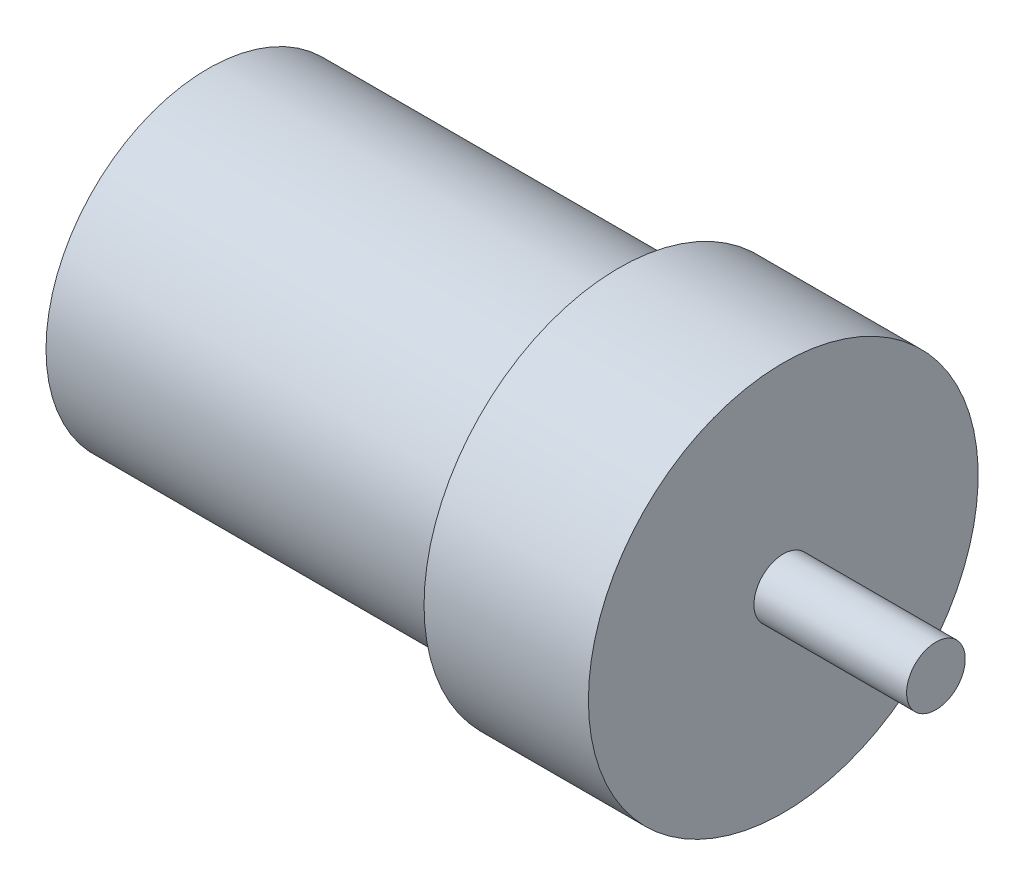
ISO-10303-21;
HEADER;
FILE_DESCRIPTION(('STEP AP214'),'2;1');
FILE_NAME('part.step','',(''),(''),'','','');
FILE_SCHEMA(('AUTOMOTIVE_DESIGN { 1 0 10303 214 1 1 1 1 }'));
ENDSEC;
DATA;
#1=APPLICATION_CONTEXT('core data for automotive mechanical design processes');
#2=APPLICATION_PROTOCOL_DEFINITION('international standard','automotive_design',2000,#1);
#3=PRODUCT_CONTEXT('',#1,'mechanical');
#4=PRODUCT('Part','Part','',(#3));
#5=PRODUCT_RELATED_PRODUCT_CATEGORY('part','',(#4));
#6=PRODUCT_DEFINITION_FORMATION('','',#4);
#7=PRODUCT_DEFINITION_CONTEXT('part definition',#1,'design');
#8=PRODUCT_DEFINITION('design','',#6,#7);
#9=PRODUCT_DEFINITION_SHAPE('','',#8);
#10=(LENGTH_UNIT() NAMED_UNIT(*) SI_UNIT(.MILLI.,.METRE.));
#11=(NAMED_UNIT(*) PLANE_ANGLE_UNIT() SI_UNIT($,.RADIAN.));
#12=(NAMED_UNIT(*) SI_UNIT($,.STERADIAN.) SOLID_ANGLE_UNIT());
#13=UNCERTAINTY_MEASURE_WITH_UNIT(LENGTH_MEASURE(1.E-05),#10,'distance_accuracy_value','');
#14=(GEOMETRIC_REPRESENTATION_CONTEXT(3) GLOBAL_UNCERTAINTY_ASSIGNED_CONTEXT((#13)) GLOBAL_UNIT_ASSIGNED_CONTEXT((#10,
#11,#12)) REPRESENTATION_CONTEXT('',''));
#15=CARTESIAN_POINT('',(0.,0.,0.));
#16=DIRECTION('',(0.,0.,1.));
#17=DIRECTION('',(1.,0.,0.));
#18=AXIS2_PLACEMENT_3D('',#15,#16,#17);
#19=CARTESIAN_POINT('',(-31.8126884096202,0.,0.));
#20=DIRECTION('',(-1.,0.,0.));
#21=DIRECTION('',(0.,0.,1.));
#22=AXIS2_PLACEMENT_3D('',#19,#20,#21);
#23=CYLINDRICAL_SURFACE('',#22,17.526);
#24=CARTESIAN_POINT('',(0.,0.,0.));
#25=DIRECTION('',(-1.,0.,0.));
#26=DIRECTION('',(0.,0.,1.));
#27=AXIS2_PLACEMENT_3D('',#24,#25,#26);
#28=CIRCLE('',#27,17.526);
#29=CARTESIAN_POINT('',(0.,0.,17.526));
#30=VERTEX_POINT('',#29);
#31=EDGE_CURVE('E10',#30,#30,#28,.T.);
#32=ORIENTED_EDGE('',*,*,#31,.F.);
#33=EDGE_LOOP('',(#32));
#34=FACE_BOUND('',#33,.T.);
#35=CARTESIAN_POINT('',(44.45,0.,0.));
#36=DIRECTION('',(-1.,0.,0.));
#37=DIRECTION('',(0.,0.,1.));
#38=AXIS2_PLACEMENT_3D('',#35,#36,#37);
#39=CIRCLE('',#38,17.526);
#40=CARTESIAN_POINT('',(44.45,0.,17.526));
#41=VERTEX_POINT('',#40);
#42=EDGE_CURVE('E59',#41,#41,#39,.T.);
#43=ORIENTED_EDGE('',*,*,#42,.T.);
#44=EDGE_LOOP('',(#43));
#45=FACE_BOUND('',#44,.T.);
#46=ADVANCED_FACE('F31',(#34,#45),#23,.T.);
#47=CARTESIAN_POINT('',(0.,9.525,0.));
#48=DIRECTION('',(1.,0.,0.));
#49=DIRECTION('',(0.,0.,-1.));
#50=AXIS2_PLACEMENT_3D('',#47,#48,#49);
#51=PLANE('',#50);
#52=CARTESIAN_POINT('',(0.,0.,0.));
#53=DIRECTION('',(-1.,0.,0.));
#54=DIRECTION('',(0.,0.,1.));
#55=AXIS2_PLACEMENT_3D('',#52,#53,#54);
#56=CIRCLE('',#55,9.525);
#57=CARTESIAN_POINT('',(0.,0.,9.525));
#58=VERTEX_POINT('',#57);
#59=EDGE_CURVE('E37',#58,#58,#56,.T.);
#60=ORIENTED_EDGE('',*,*,#59,.F.);
#61=EDGE_LOOP('',(#60));
#62=FACE_BOUND('',#61,.T.);
#63=ORIENTED_EDGE('',*,*,#31,.T.);
#64=EDGE_LOOP('',(#63));
#65=FACE_BOUND('',#64,.T.);
#66=ADVANCED_FACE('F99',(#62,#65),#51,.F.);
#67=CARTESIAN_POINT('',(-31.8126884096202,0.,0.));
#68=DIRECTION('',(-1.,0.,0.));
#69=DIRECTION('',(0.,0.,1.));
#70=AXIS2_PLACEMENT_3D('',#67,#68,#69);
#71=CYLINDRICAL_SURFACE('',#70,9.525);
#72=CARTESIAN_POINT('',(45.72,0.,0.));
#73=DIRECTION('',(-1.,0.,0.));
#74=DIRECTION('',(0.,0.,1.));
#75=AXIS2_PLACEMENT_3D('',#72,#73,#74);
#76=CIRCLE('',#75,9.525);
#77=CARTESIAN_POINT('',(45.72,0.,9.525));
#78=VERTEX_POINT('',#77);
#79=EDGE_CURVE('E41',#78,#78,#76,.T.);
#80=ORIENTED_EDGE('',*,*,#79,.F.);
#81=EDGE_LOOP('',(#80));
#82=FACE_BOUND('',#81,.T.);
#83=ORIENTED_EDGE('',*,*,#59,.T.);
#84=EDGE_LOOP('',(#83));
#85=FACE_BOUND('',#84,.T.);
#86=ADVANCED_FACE('F95',(#82,#85),#71,.F.);
#87=CARTESIAN_POINT('',(45.72,9.525,0.));
#88=DIRECTION('',(1.,0.,0.));
#89=DIRECTION('',(0.,0.,-1.));
#90=AXIS2_PLACEMENT_3D('',#87,#88,#89);
#91=PLANE('',#90);
#92=ORIENTED_EDGE('',*,*,#79,.T.);
#93=EDGE_LOOP('',(#92));
#94=FACE_BOUND('',#93,.T.);
#95=ADVANCED_FACE('F90',(#94),#91,.F.);
#96=CARTESIAN_POINT('',(78.74,3.175,0.));
#97=DIRECTION('',(-1.,0.,0.));
#98=DIRECTION('',(0.,0.,1.));
#99=AXIS2_PLACEMENT_3D('',#96,#97,#98);
#100=PLANE('',#99);
#101=CARTESIAN_POINT('',(78.74,0.,0.));
#102=DIRECTION('',(-1.,0.,0.));
#103=DIRECTION('',(0.,0.,1.));
#104=AXIS2_PLACEMENT_3D('',#101,#102,#103);
#105=CIRCLE('',#104,3.175);
#106=CARTESIAN_POINT('',(78.74,0.,3.175));
#107=VERTEX_POINT('',#106);
#108=EDGE_CURVE('E45',#107,#107,#105,.T.);
#109=ORIENTED_EDGE('',*,*,#108,.F.);
#110=EDGE_LOOP('',(#109));
#111=FACE_BOUND('',#110,.T.);
#112=ADVANCED_FACE('F85',(#111),#100,.F.);
#113=CARTESIAN_POINT('',(-31.8126884096202,0.,0.));
#114=DIRECTION('',(-1.,0.,0.));
#115=DIRECTION('',(0.,0.,1.));
#116=AXIS2_PLACEMENT_3D('',#113,#114,#115);
#117=CYLINDRICAL_SURFACE('',#116,3.175);
#118=CARTESIAN_POINT('',(62.23,0.,0.));
#119=DIRECTION('',(-1.,0.,0.));
#120=DIRECTION('',(0.,0.,1.));
#121=AXIS2_PLACEMENT_3D('',#118,#119,#120);
#122=CIRCLE('',#121,3.175);
#123=CARTESIAN_POINT('',(62.23,0.,3.175));
#124=VERTEX_POINT('',#123);
#125=EDGE_CURVE('E50',#124,#124,#122,.T.);
#126=ORIENTED_EDGE('',*,*,#125,.F.);
#127=EDGE_LOOP('',(#126));
#128=FACE_BOUND('',#127,.T.);
#129=ORIENTED_EDGE('',*,*,#108,.T.);
#130=EDGE_LOOP('',(#129));
#131=FACE_BOUND('',#130,.T.);
#132=ADVANCED_FACE('F79',(#128,#131),#117,.T.);
#133=CARTESIAN_POINT('',(62.23,21.082,0.));
#134=DIRECTION('',(-1.,0.,0.));
#135=DIRECTION('',(0.,0.,1.));
#136=AXIS2_PLACEMENT_3D('',#133,#134,#135);
#137=PLANE('',#136);
#138=CARTESIAN_POINT('',(62.23,0.,0.));
#139=DIRECTION('',(-1.,0.,0.));
#140=DIRECTION('',(0.,0.,1.));
#141=AXIS2_PLACEMENT_3D('',#138,#139,#140);
#142=CIRCLE('',#141,21.082);
#143=CARTESIAN_POINT('',(62.23,0.,21.082));
#144=VERTEX_POINT('',#143);
#145=EDGE_CURVE('E53',#144,#144,#142,.T.);
#146=ORIENTED_EDGE('',*,*,#145,.F.);
#147=EDGE_LOOP('',(#146));
#148=FACE_BOUND('',#147,.T.);
#149=ORIENTED_EDGE('',*,*,#125,.T.);
#150=EDGE_LOOP('',(#149));
#151=FACE_BOUND('',#150,.T.);
#152=ADVANCED_FACE('F73',(#148,#151),#137,.F.);
#153=CARTESIAN_POINT('',(-31.8126884096202,0.,0.));
#154=DIRECTION('',(-1.,0.,0.));
#155=DIRECTION('',(0.,0.,1.));
#156=AXIS2_PLACEMENT_3D('',#153,#154,#155);
#157=CYLINDRICAL_SURFACE('',#156,21.082);
#158=CARTESIAN_POINT('',(44.45,0.,0.));
#159=DIRECTION('',(-1.,0.,0.));
#160=DIRECTION('',(0.,0.,1.));
#161=AXIS2_PLACEMENT_3D('',#158,#159,#160);
#162=CIRCLE('',#161,21.082);
#163=CARTESIAN_POINT('',(44.45,0.,21.082));
#164=VERTEX_POINT('',#163);
#165=EDGE_CURVE('E56',#164,#164,#162,.T.);
#166=ORIENTED_EDGE('',*,*,#165,.F.);
#167=EDGE_LOOP('',(#166));
#168=FACE_BOUND('',#167,.T.);
#169=ORIENTED_EDGE('',*,*,#145,.T.);
#170=EDGE_LOOP('',(#169));
#171=FACE_BOUND('',#170,.T.);
#172=ADVANCED_FACE('F67',(#168,#171),#157,.T.);
#173=CARTESIAN_POINT('',(44.45,17.526,0.));
#174=DIRECTION('',(1.,0.,0.));
#175=DIRECTION('',(0.,0.,-1.));
#176=AXIS2_PLACEMENT_3D('',#173,#174,#175);
#177=PLANE('',#176);
#178=ORIENTED_EDGE('',*,*,#42,.F.);
#179=EDGE_LOOP('',(#178));
#180=FACE_BOUND('',#179,.T.);
#181=ORIENTED_EDGE('',*,*,#165,.T.);
#182=EDGE_LOOP('',(#181));
#183=FACE_BOUND('',#182,.T.);
#184=ADVANCED_FACE('F64',(#180,#183),#177,.F.);
#185=CLOSED_SHELL('',(#46,#66,#86,#95,#112,#132,#152,#172,#184));
#186=MANIFOLD_SOLID_BREP('B2',#185);
#187=ADVANCED_BREP_SHAPE_REPRESENTATION('',(#18,#186),#14);
#188=SHAPE_DEFINITION_REPRESENTATION(#9,#187);
ENDSEC;
END-ISO-10303-21;
